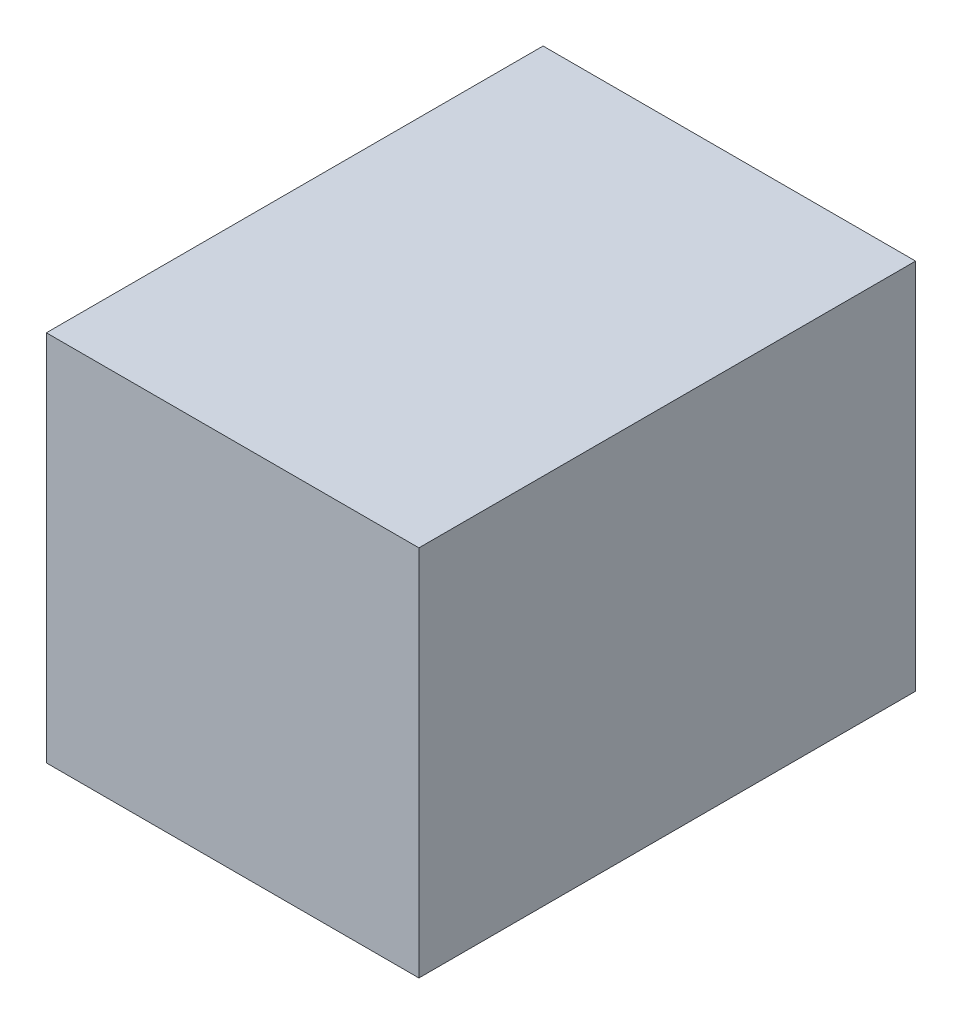
ISO-10303-21;
HEADER;
FILE_DESCRIPTION(('STEP AP214'),'2;1');
FILE_NAME('part.step','',(''),(''),'','','');
FILE_SCHEMA(('AUTOMOTIVE_DESIGN { 1 0 10303 214 1 1 1 1 }'));
ENDSEC;
DATA;
#1=APPLICATION_CONTEXT('core data for automotive mechanical design processes');
#2=APPLICATION_PROTOCOL_DEFINITION('international standard','automotive_design',2000,#1);
#3=PRODUCT_CONTEXT('',#1,'mechanical');
#4=PRODUCT('Part','Part','',(#3));
#5=PRODUCT_RELATED_PRODUCT_CATEGORY('part','',(#4));
#6=PRODUCT_DEFINITION_FORMATION('','',#4);
#7=PRODUCT_DEFINITION_CONTEXT('part definition',#1,'design');
#8=PRODUCT_DEFINITION('design','',#6,#7);
#9=PRODUCT_DEFINITION_SHAPE('','',#8);
#10=(LENGTH_UNIT() NAMED_UNIT(*) SI_UNIT(.MILLI.,.METRE.));
#11=(NAMED_UNIT(*) PLANE_ANGLE_UNIT() SI_UNIT($,.RADIAN.));
#12=(NAMED_UNIT(*) SI_UNIT($,.STERADIAN.) SOLID_ANGLE_UNIT());
#13=UNCERTAINTY_MEASURE_WITH_UNIT(LENGTH_MEASURE(1.E-05),#10,'distance_accuracy_value','');
#14=(GEOMETRIC_REPRESENTATION_CONTEXT(3) GLOBAL_UNCERTAINTY_ASSIGNED_CONTEXT((#13)) GLOBAL_UNIT_ASSIGNED_CONTEXT((#10,
#11,#12)) REPRESENTATION_CONTEXT('',''));
#15=CARTESIAN_POINT('',(0.,0.,0.));
#16=DIRECTION('',(0.,0.,1.));
#17=DIRECTION('',(1.,0.,0.));
#18=AXIS2_PLACEMENT_3D('',#15,#16,#17);
#19=CARTESIAN_POINT('',(-101.855476328306,24.5165873959572,80.));
#20=DIRECTION('',(1.,0.,0.));
#21=DIRECTION('',(0.,1.,0.));
#22=AXIS2_PLACEMENT_3D('',#19,#20,#21);
#23=PLANE('',#22);
#24=DIRECTION('',(0.,-1.,0.));
#25=VECTOR('',#24,1.);
#26=CARTESIAN_POINT('',(-101.855476328306,24.5165873959572,0.));
#27=LINE('',#26,#25);
#28=CARTESIAN_POINT('',(-101.855476328306,24.5165873959572,0.));
#29=VERTEX_POINT('',#28);
#30=CARTESIAN_POINT('',(-101.855476328306,-35.4834126040428,0.));
#31=VERTEX_POINT('',#30);
#32=EDGE_CURVE('E96',#29,#31,#27,.T.);
#33=ORIENTED_EDGE('',*,*,#32,.T.);
#34=DIRECTION('',(0.,0.,-1.));
#35=VECTOR('',#34,1.);
#36=CARTESIAN_POINT('',(-101.855476328306,-35.4834126040428,80.));
#37=LINE('',#36,#35);
#38=CARTESIAN_POINT('',(-101.855476328306,-35.4834126040428,80.));
#39=VERTEX_POINT('',#38);
#40=EDGE_CURVE('E11',#39,#31,#37,.T.);
#41=ORIENTED_EDGE('',*,*,#40,.F.);
#42=DIRECTION('',(0.,-1.,0.));
#43=VECTOR('',#42,1.);
#44=CARTESIAN_POINT('',(-101.855476328306,24.5165873959572,80.));
#45=LINE('',#44,#43);
#46=CARTESIAN_POINT('',(-101.855476328306,24.5165873959572,80.));
#47=VERTEX_POINT('',#46);
#48=EDGE_CURVE('E84',#47,#39,#45,.T.);
#49=ORIENTED_EDGE('',*,*,#48,.F.);
#50=DIRECTION('',(0.,0.,-1.));
#51=VECTOR('',#50,1.);
#52=CARTESIAN_POINT('',(-101.855476328306,24.5165873959572,80.));
#53=LINE('',#52,#51);
#54=EDGE_CURVE('E92',#47,#29,#53,.T.);
#55=ORIENTED_EDGE('',*,*,#54,.T.);
#56=EDGE_LOOP('',(#33,#41,#49,#55));
#57=FACE_BOUND('',#56,.T.);
#58=ADVANCED_FACE('F33',(#57),#23,.F.);
#59=CARTESIAN_POINT('',(-101.855476328306,-35.4834126040428,80.));
#60=DIRECTION('',(0.,1.,0.));
#61=DIRECTION('',(0.,0.,1.));
#62=AXIS2_PLACEMENT_3D('',#59,#60,#61);
#63=PLANE('',#62);
#64=DIRECTION('',(1.,0.,0.));
#65=VECTOR('',#64,1.);
#66=CARTESIAN_POINT('',(-101.855476328306,-35.4834126040428,0.));
#67=LINE('',#66,#65);
#68=CARTESIAN_POINT('',(-41.8554763283059,-35.4834126040428,0.));
#69=VERTEX_POINT('',#68);
#70=EDGE_CURVE('E88',#31,#69,#67,.T.);
#71=ORIENTED_EDGE('',*,*,#70,.T.);
#72=DIRECTION('',(0.,0.,-1.));
#73=VECTOR('',#72,1.);
#74=CARTESIAN_POINT('',(-41.8554763283059,-35.4834126040428,80.));
#75=LINE('',#74,#73);
#76=CARTESIAN_POINT('',(-41.8554763283059,-35.4834126040428,80.));
#77=VERTEX_POINT('',#76);
#78=EDGE_CURVE('E41',#77,#69,#75,.T.);
#79=ORIENTED_EDGE('',*,*,#78,.F.);
#80=DIRECTION('',(1.,0.,0.));
#81=VECTOR('',#80,1.);
#82=CARTESIAN_POINT('',(-101.855476328306,-35.4834126040428,80.));
#83=LINE('',#82,#81);
#84=EDGE_CURVE('E79',#39,#77,#83,.T.);
#85=ORIENTED_EDGE('',*,*,#84,.F.);
#86=ORIENTED_EDGE('',*,*,#40,.T.);
#87=EDGE_LOOP('',(#71,#79,#85,#86));
#88=FACE_BOUND('',#87,.T.);
#89=ADVANCED_FACE('F87',(#88),#63,.F.);
#90=CARTESIAN_POINT('',(-41.8554763283059,24.5165873959572,80.));
#91=DIRECTION('',(-1.,0.,0.));
#92=DIRECTION('',(0.,-1.,0.));
#93=AXIS2_PLACEMENT_3D('',#90,#91,#92);
#94=PLANE('',#93);
#95=DIRECTION('',(0.,1.,0.));
#96=VECTOR('',#95,1.);
#97=CARTESIAN_POINT('',(-41.8554763283059,24.5165873959572,0.));
#98=LINE('',#97,#96);
#99=CARTESIAN_POINT('',(-41.8554763283059,24.5165873959572,0.));
#100=VERTEX_POINT('',#99);
#101=EDGE_CURVE('E66',#69,#100,#98,.T.);
#102=ORIENTED_EDGE('',*,*,#101,.T.);
#103=DIRECTION('',(0.,0.,-1.));
#104=VECTOR('',#103,1.);
#105=CARTESIAN_POINT('',(-41.8554763283059,24.5165873959572,80.));
#106=LINE('',#105,#104);
#107=CARTESIAN_POINT('',(-41.8554763283059,24.5165873959572,80.));
#108=VERTEX_POINT('',#107);
#109=EDGE_CURVE('E89',#108,#100,#106,.T.);
#110=ORIENTED_EDGE('',*,*,#109,.F.);
#111=DIRECTION('',(0.,1.,0.));
#112=VECTOR('',#111,1.);
#113=CARTESIAN_POINT('',(-41.8554763283059,24.5165873959572,80.));
#114=LINE('',#113,#112);
#115=EDGE_CURVE('E82',#77,#108,#114,.T.);
#116=ORIENTED_EDGE('',*,*,#115,.F.);
#117=ORIENTED_EDGE('',*,*,#78,.T.);
#118=EDGE_LOOP('',(#102,#110,#116,#117));
#119=FACE_BOUND('',#118,.T.);
#120=ADVANCED_FACE('F90',(#119),#94,.F.);
#121=CARTESIAN_POINT('',(-101.855476328306,24.5165873959572,80.));
#122=DIRECTION('',(0.,-1.,0.));
#123=DIRECTION('',(0.,0.,-1.));
#124=AXIS2_PLACEMENT_3D('',#121,#122,#123);
#125=PLANE('',#124);
#126=DIRECTION('',(-1.,0.,0.));
#127=VECTOR('',#126,1.);
#128=CARTESIAN_POINT('',(-101.855476328306,24.5165873959572,0.));
#129=LINE('',#128,#127);
#130=EDGE_CURVE('E72',#100,#29,#129,.T.);
#131=ORIENTED_EDGE('',*,*,#130,.T.);
#132=ORIENTED_EDGE('',*,*,#54,.F.);
#133=DIRECTION('',(-1.,0.,0.));
#134=VECTOR('',#133,1.);
#135=CARTESIAN_POINT('',(-101.855476328306,24.5165873959572,80.));
#136=LINE('',#135,#134);
#137=EDGE_CURVE('E49',#108,#47,#136,.T.);
#138=ORIENTED_EDGE('',*,*,#137,.F.);
#139=ORIENTED_EDGE('',*,*,#109,.T.);
#140=EDGE_LOOP('',(#131,#132,#138,#139));
#141=FACE_BOUND('',#140,.T.);
#142=ADVANCED_FACE('F103',(#141),#125,.F.);
#143=CARTESIAN_POINT('',(0.,0.,80.));
#144=DIRECTION('',(0.,0.,1.));
#145=DIRECTION('',(1.,0.,0.));
#146=AXIS2_PLACEMENT_3D('',#143,#144,#145);
#147=PLANE('',#146);
#148=ORIENTED_EDGE('',*,*,#48,.T.);
#149=ORIENTED_EDGE('',*,*,#84,.T.);
#150=ORIENTED_EDGE('',*,*,#115,.T.);
#151=ORIENTED_EDGE('',*,*,#137,.T.);
#152=EDGE_LOOP('',(#148,#149,#150,#151));
#153=FACE_BOUND('',#152,.T.);
#154=ADVANCED_FACE('F80',(#153),#147,.T.);
#155=CARTESIAN_POINT('',(0.,0.,0.));
#156=DIRECTION('',(0.,0.,1.));
#157=DIRECTION('',(1.,0.,0.));
#158=AXIS2_PLACEMENT_3D('',#155,#156,#157);
#159=PLANE('',#158);
#160=ORIENTED_EDGE('',*,*,#32,.F.);
#161=ORIENTED_EDGE('',*,*,#130,.F.);
#162=ORIENTED_EDGE('',*,*,#101,.F.);
#163=ORIENTED_EDGE('',*,*,#70,.F.);
#164=EDGE_LOOP('',(#160,#161,#162,#163));
#165=FACE_BOUND('',#164,.T.);
#166=ADVANCED_FACE('F106',(#165),#159,.F.);
#167=CLOSED_SHELL('',(#58,#89,#120,#142,#154,#166));
#168=MANIFOLD_SOLID_BREP('B2',#167);
#169=ADVANCED_BREP_SHAPE_REPRESENTATION('',(#18,#168),#14);
#170=SHAPE_DEFINITION_REPRESENTATION(#9,#169);
ENDSEC;
END-ISO-10303-21;
